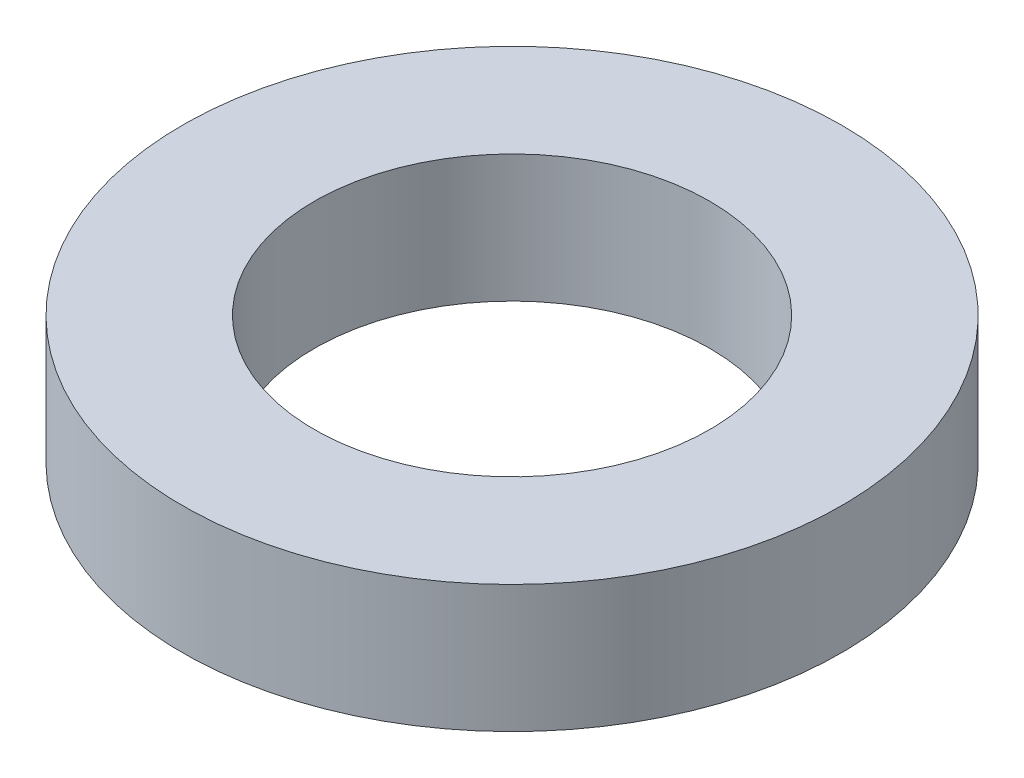
ISO-10303-21;
HEADER;
FILE_DESCRIPTION(('STEP AP214'),'2;1');
FILE_NAME('part.step','',(''),(''),'','','');
FILE_SCHEMA(('AUTOMOTIVE_DESIGN { 1 0 10303 214 1 1 1 1 }'));
ENDSEC;
DATA;
#1=APPLICATION_CONTEXT('core data for automotive mechanical design processes');
#2=APPLICATION_PROTOCOL_DEFINITION('international standard','automotive_design',2000,#1);
#3=PRODUCT_CONTEXT('',#1,'mechanical');
#4=PRODUCT('Part','Part','',(#3));
#5=PRODUCT_RELATED_PRODUCT_CATEGORY('part','',(#4));
#6=PRODUCT_DEFINITION_FORMATION('','',#4);
#7=PRODUCT_DEFINITION_CONTEXT('part definition',#1,'design');
#8=PRODUCT_DEFINITION('design','',#6,#7);
#9=PRODUCT_DEFINITION_SHAPE('','',#8);
#10=(LENGTH_UNIT() NAMED_UNIT(*) SI_UNIT(.MILLI.,.METRE.));
#11=(NAMED_UNIT(*) PLANE_ANGLE_UNIT() SI_UNIT($,.RADIAN.));
#12=(NAMED_UNIT(*) SI_UNIT($,.STERADIAN.) SOLID_ANGLE_UNIT());
#13=UNCERTAINTY_MEASURE_WITH_UNIT(LENGTH_MEASURE(1.E-05),#10,'distance_accuracy_value','');
#14=(GEOMETRIC_REPRESENTATION_CONTEXT(3) GLOBAL_UNCERTAINTY_ASSIGNED_CONTEXT((#13)) GLOBAL_UNIT_ASSIGNED_CONTEXT((#10,
#11,#12)) REPRESENTATION_CONTEXT('',''));
#15=CARTESIAN_POINT('',(0.,0.,0.));
#16=DIRECTION('',(0.,0.,1.));
#17=DIRECTION('',(1.,0.,0.));
#18=AXIS2_PLACEMENT_3D('',#15,#16,#17);
#19=CARTESIAN_POINT('',(0.,29.,0.));
#20=DIRECTION('',(0.,-1.,0.));
#21=DIRECTION('',(0.,0.,-1.));
#22=AXIS2_PLACEMENT_3D('',#19,#20,#21);
#23=CYLINDRICAL_SURFACE('',#22,75.);
#24=CARTESIAN_POINT('',(0.,29.,0.));
#25=DIRECTION('',(0.,1.,0.));
#26=DIRECTION('',(0.,0.,1.));
#27=AXIS2_PLACEMENT_3D('',#24,#25,#26);
#28=CIRCLE('',#27,75.);
#29=CARTESIAN_POINT('',(0.,29.,-75.));
#30=VERTEX_POINT('',#29);
#31=EDGE_CURVE('E10',#30,#30,#28,.T.);
#32=CARTESIAN_POINT('',(0.,0.,0.));
#33=DIRECTION('',(0.,1.,0.));
#34=DIRECTION('',(0.,0.,1.));
#35=AXIS2_PLACEMENT_3D('',#32,#33,#34);
#36=CIRCLE('',#35,75.);
#37=CARTESIAN_POINT('',(0.,0.,-75.));
#38=VERTEX_POINT('',#37);
#39=EDGE_CURVE('E37',#38,#38,#36,.T.);
#40=CARTESIAN_POINT('',(0.,29.,-75.));
#41=CARTESIAN_POINT('',(0.,28.6979166666667,-75.));
#42=CARTESIAN_POINT('',(0.,28.3958333333333,-75.));
#43=CARTESIAN_POINT('',(0.,27.7916666666667,-75.));
#44=CARTESIAN_POINT('',(0.,27.4895833333333,-75.));
#45=CARTESIAN_POINT('',(0.,26.8854166666667,-75.));
#46=CARTESIAN_POINT('',(0.,26.5833333333333,-75.));
#47=CARTESIAN_POINT('',(0.,25.9791666666667,-75.));
#48=CARTESIAN_POINT('',(0.,25.6770833333333,-75.));
#49=CARTESIAN_POINT('',(0.,25.0729166666667,-75.));
#50=CARTESIAN_POINT('',(0.,24.7708333333333,-75.));
#51=CARTESIAN_POINT('',(0.,24.1666666666667,-75.));
#52=CARTESIAN_POINT('',(0.,23.8645833333333,-75.));
#53=CARTESIAN_POINT('',(0.,23.2604166666667,-75.));
#54=CARTESIAN_POINT('',(0.,22.9583333333333,-75.));
#55=CARTESIAN_POINT('',(0.,22.3541666666667,-75.));
#56=CARTESIAN_POINT('',(0.,22.0520833333333,-75.));
#57=CARTESIAN_POINT('',(0.,21.4479166666667,-75.));
#58=CARTESIAN_POINT('',(0.,21.1458333333333,-75.));
#59=CARTESIAN_POINT('',(0.,20.5416666666667,-75.));
#60=CARTESIAN_POINT('',(0.,20.2395833333333,-75.));
#61=CARTESIAN_POINT('',(0.,19.6354166666667,-75.));
#62=CARTESIAN_POINT('',(0.,19.3333333333333,-75.));
#63=CARTESIAN_POINT('',(0.,18.7291666666667,-75.));
#64=CARTESIAN_POINT('',(0.,18.4270833333333,-75.));
#65=CARTESIAN_POINT('',(0.,17.8229166666667,-75.));
#66=CARTESIAN_POINT('',(0.,17.5208333333333,-75.));
#67=CARTESIAN_POINT('',(0.,16.9166666666667,-75.));
#68=CARTESIAN_POINT('',(0.,16.6145833333333,-75.));
#69=CARTESIAN_POINT('',(0.,16.0104166666667,-75.));
#70=CARTESIAN_POINT('',(0.,15.7083333333333,-75.));
#71=CARTESIAN_POINT('',(0.,15.1041666666667,-75.));
#72=CARTESIAN_POINT('',(0.,14.8020833333333,-75.));
#73=CARTESIAN_POINT('',(0.,14.1979166666667,-75.));
#74=CARTESIAN_POINT('',(0.,13.8958333333333,-75.));
#75=CARTESIAN_POINT('',(0.,13.2916666666667,-75.));
#76=CARTESIAN_POINT('',(0.,12.9895833333333,-75.));
#77=CARTESIAN_POINT('',(0.,12.3854166666667,-75.));
#78=CARTESIAN_POINT('',(0.,12.0833333333333,-75.));
#79=CARTESIAN_POINT('',(0.,11.4791666666667,-75.));
#80=CARTESIAN_POINT('',(0.,11.1770833333333,-75.));
#81=CARTESIAN_POINT('',(0.,10.5729166666667,-75.));
#82=CARTESIAN_POINT('',(0.,10.2708333333333,-75.));
#83=CARTESIAN_POINT('',(0.,9.66666666666667,-75.));
#84=CARTESIAN_POINT('',(0.,9.36458333333333,-75.));
#85=CARTESIAN_POINT('',(0.,8.76041666666667,-75.));
#86=CARTESIAN_POINT('',(0.,8.45833333333333,-75.));
#87=CARTESIAN_POINT('',(0.,7.85416666666667,-75.));
#88=CARTESIAN_POINT('',(0.,7.55208333333333,-75.));
#89=CARTESIAN_POINT('',(0.,6.94791666666667,-75.));
#90=CARTESIAN_POINT('',(0.,6.64583333333333,-75.));
#91=CARTESIAN_POINT('',(0.,6.04166666666667,-75.));
#92=CARTESIAN_POINT('',(0.,5.73958333333333,-75.));
#93=CARTESIAN_POINT('',(0.,5.13541666666667,-75.));
#94=CARTESIAN_POINT('',(0.,4.83333333333333,-75.));
#95=CARTESIAN_POINT('',(0.,4.22916666666667,-75.));
#96=CARTESIAN_POINT('',(0.,3.92708333333333,-75.));
#97=CARTESIAN_POINT('',(0.,3.32291666666667,-75.));
#98=CARTESIAN_POINT('',(0.,3.02083333333333,-75.));
#99=CARTESIAN_POINT('',(0.,2.41666666666667,-75.));
#100=CARTESIAN_POINT('',(0.,2.11458333333333,-75.));
#101=CARTESIAN_POINT('',(0.,1.51041666666667,-75.));
#102=CARTESIAN_POINT('',(0.,1.20833333333333,-75.));
#103=CARTESIAN_POINT('',(0.,0.604166666666667,-75.));
#104=CARTESIAN_POINT('',(0.,0.302083333333333,-75.));
#105=CARTESIAN_POINT('',(0.,0.,-75.));
#106=B_SPLINE_CURVE_WITH_KNOTS('',3,(#40,#41,#42,#43,#44,#45,#46,#47,#48,#49,#50,#51,#52,#53,
#54,#55,#56,#57,#58,#59,#60,#61,#62,#63,#64,#65,#66,#67,#68,#69,#70,#71,#72,#73,#74,#75,#76,#77,
#78,#79,#80,#81,#82,#83,#84,#85,#86,#87,#88,#89,#90,#91,#92,#93,#94,#95,#96,#97,#98,#99,#100,
#101,#102,#103,#104,#105),.UNSPECIFIED.,.F.,.F.,(4,2,2,2,2,2,2,2,2,2,2,2,2,2,2,2,2,2,2,2,2,2,2,
2,2,2,2,2,2,2,2,2,4),(0.,0.906250000000001,1.8125,2.71875,3.625,4.53125,5.4375,6.34375,7.25,
8.15625,9.0625,9.96875,10.875,11.78125,12.6875,13.59375,14.5,15.40625,16.3125,17.21875,18.125,
19.03125,19.9375,20.84375,21.75,22.65625,23.5625,24.46875,25.375,26.28125,27.1875,28.09375,29.),.UNSPECIFIED.);
#107=EDGE_CURVE('BSEAM40',#30,#38,#106,.T.);
#108=ORIENTED_EDGE('',*,*,#31,.F.);
#109=ORIENTED_EDGE('',*,*,#39,.T.);
#110=ORIENTED_EDGE('',*,*,#107,.T.);
#111=ORIENTED_EDGE('',*,*,#107,.F.);
#112=EDGE_LOOP('',(#108,#110,#109,#111));
#113=FACE_BOUND('',#112,.T.);
#114=ADVANCED_FACE('F40',(#113),#23,.T.);
#115=CARTESIAN_POINT('',(0.,29.,0.));
#116=DIRECTION('',(0.,1.,0.));
#117=DIRECTION('',(0.,0.,1.));
#118=AXIS2_PLACEMENT_3D('',#115,#116,#117);
#119=PLANE('',#118);
#120=CARTESIAN_POINT('',(0.,29.,0.));
#121=DIRECTION('',(0.,1.,0.));
#122=DIRECTION('',(0.,0.,1.));
#123=AXIS2_PLACEMENT_3D('',#120,#121,#122);
#124=CIRCLE('',#123,45.);
#125=CARTESIAN_POINT('',(0.,29.,-45.));
#126=VERTEX_POINT('',#125);
#127=EDGE_CURVE('E50',#126,#126,#124,.T.);
#128=ORIENTED_EDGE('',*,*,#127,.F.);
#129=EDGE_LOOP('',(#128));
#130=FACE_BOUND('',#129,.T.);
#131=ORIENTED_EDGE('',*,*,#31,.T.);
#132=EDGE_LOOP('',(#131));
#133=FACE_BOUND('',#132,.T.);
#134=ADVANCED_FACE('F59',(#130,#133),#119,.T.);
#135=CARTESIAN_POINT('',(0.,0.,0.));
#136=DIRECTION('',(0.,1.,0.));
#137=DIRECTION('',(0.,0.,1.));
#138=AXIS2_PLACEMENT_3D('',#135,#136,#137);
#139=PLANE('',#138);
#140=CARTESIAN_POINT('',(0.,0.,0.));
#141=DIRECTION('',(0.,1.,0.));
#142=DIRECTION('',(0.,0.,1.));
#143=AXIS2_PLACEMENT_3D('',#140,#141,#142);
#144=CIRCLE('',#143,45.);
#145=CARTESIAN_POINT('',(0.,0.,-45.));
#146=VERTEX_POINT('',#145);
#147=EDGE_CURVE('E47',#146,#146,#144,.T.);
#148=ORIENTED_EDGE('',*,*,#147,.T.);
#149=EDGE_LOOP('',(#148));
#150=FACE_BOUND('',#149,.T.);
#151=ORIENTED_EDGE('',*,*,#39,.F.);
#152=EDGE_LOOP('',(#151));
#153=FACE_BOUND('',#152,.T.);
#154=ADVANCED_FACE('F58',(#150,#153),#139,.F.);
#155=CARTESIAN_POINT('',(0.,29.,0.));
#156=DIRECTION('',(0.,-1.,0.));
#157=DIRECTION('',(0.,0.,-1.));
#158=AXIS2_PLACEMENT_3D('',#155,#156,#157);
#159=CYLINDRICAL_SURFACE('',#158,45.);
#160=CARTESIAN_POINT('',(0.,29.,-45.));
#161=CARTESIAN_POINT('',(0.,28.6979166666667,-45.));
#162=CARTESIAN_POINT('',(0.,28.3958333333333,-45.));
#163=CARTESIAN_POINT('',(0.,27.7916666666667,-45.));
#164=CARTESIAN_POINT('',(0.,27.4895833333333,-45.));
#165=CARTESIAN_POINT('',(0.,26.8854166666667,-45.));
#166=CARTESIAN_POINT('',(0.,26.5833333333333,-45.));
#167=CARTESIAN_POINT('',(0.,25.9791666666667,-45.));
#168=CARTESIAN_POINT('',(0.,25.6770833333333,-45.));
#169=CARTESIAN_POINT('',(0.,25.0729166666667,-45.));
#170=CARTESIAN_POINT('',(0.,24.7708333333333,-45.));
#171=CARTESIAN_POINT('',(0.,24.1666666666667,-45.));
#172=CARTESIAN_POINT('',(0.,23.8645833333333,-45.));
#173=CARTESIAN_POINT('',(0.,23.2604166666667,-45.));
#174=CARTESIAN_POINT('',(0.,22.9583333333333,-45.));
#175=CARTESIAN_POINT('',(0.,22.3541666666667,-45.));
#176=CARTESIAN_POINT('',(0.,22.0520833333333,-45.));
#177=CARTESIAN_POINT('',(0.,21.4479166666667,-45.));
#178=CARTESIAN_POINT('',(0.,21.1458333333333,-45.));
#179=CARTESIAN_POINT('',(0.,20.5416666666667,-45.));
#180=CARTESIAN_POINT('',(0.,20.2395833333333,-45.));
#181=CARTESIAN_POINT('',(0.,19.6354166666667,-45.));
#182=CARTESIAN_POINT('',(0.,19.3333333333333,-45.));
#183=CARTESIAN_POINT('',(0.,18.7291666666667,-45.));
#184=CARTESIAN_POINT('',(0.,18.4270833333333,-45.));
#185=CARTESIAN_POINT('',(0.,17.8229166666667,-45.));
#186=CARTESIAN_POINT('',(0.,17.5208333333333,-45.));
#187=CARTESIAN_POINT('',(0.,16.9166666666667,-45.));
#188=CARTESIAN_POINT('',(0.,16.6145833333333,-45.));
#189=CARTESIAN_POINT('',(0.,16.0104166666667,-45.));
#190=CARTESIAN_POINT('',(0.,15.7083333333333,-45.));
#191=CARTESIAN_POINT('',(0.,15.1041666666667,-45.));
#192=CARTESIAN_POINT('',(0.,14.8020833333333,-45.));
#193=CARTESIAN_POINT('',(0.,14.1979166666667,-45.));
#194=CARTESIAN_POINT('',(0.,13.8958333333333,-45.));
#195=CARTESIAN_POINT('',(0.,13.2916666666667,-45.));
#196=CARTESIAN_POINT('',(0.,12.9895833333333,-45.));
#197=CARTESIAN_POINT('',(0.,12.3854166666667,-45.));
#198=CARTESIAN_POINT('',(0.,12.0833333333333,-45.));
#199=CARTESIAN_POINT('',(0.,11.4791666666667,-45.));
#200=CARTESIAN_POINT('',(0.,11.1770833333333,-45.));
#201=CARTESIAN_POINT('',(0.,10.5729166666667,-45.));
#202=CARTESIAN_POINT('',(0.,10.2708333333333,-45.));
#203=CARTESIAN_POINT('',(0.,9.66666666666667,-45.));
#204=CARTESIAN_POINT('',(0.,9.36458333333333,-45.));
#205=CARTESIAN_POINT('',(0.,8.76041666666667,-45.));
#206=CARTESIAN_POINT('',(0.,8.45833333333333,-45.));
#207=CARTESIAN_POINT('',(0.,7.85416666666667,-45.));
#208=CARTESIAN_POINT('',(0.,7.55208333333333,-45.));
#209=CARTESIAN_POINT('',(0.,6.94791666666667,-45.));
#210=CARTESIAN_POINT('',(0.,6.64583333333333,-45.));
#211=CARTESIAN_POINT('',(0.,6.04166666666667,-45.));
#212=CARTESIAN_POINT('',(0.,5.73958333333333,-45.));
#213=CARTESIAN_POINT('',(0.,5.13541666666667,-45.));
#214=CARTESIAN_POINT('',(0.,4.83333333333333,-45.));
#215=CARTESIAN_POINT('',(0.,4.22916666666667,-45.));
#216=CARTESIAN_POINT('',(0.,3.92708333333333,-45.));
#217=CARTESIAN_POINT('',(0.,3.32291666666667,-45.));
#218=CARTESIAN_POINT('',(0.,3.02083333333333,-45.));
#219=CARTESIAN_POINT('',(0.,2.41666666666667,-45.));
#220=CARTESIAN_POINT('',(0.,2.11458333333333,-45.));
#221=CARTESIAN_POINT('',(0.,1.51041666666667,-45.));
#222=CARTESIAN_POINT('',(0.,1.20833333333333,-45.));
#223=CARTESIAN_POINT('',(0.,0.604166666666667,-45.));
#224=CARTESIAN_POINT('',(0.,0.302083333333333,-45.));
#225=CARTESIAN_POINT('',(0.,0.,-45.));
#226=B_SPLINE_CURVE_WITH_KNOTS('',3,(#160,#161,#162,#163,#164,#165,#166,#167,#168,#169,#170,
#171,#172,#173,#174,#175,#176,#177,#178,#179,#180,#181,#182,#183,#184,#185,#186,#187,#188,#189,
#190,#191,#192,#193,#194,#195,#196,#197,#198,#199,#200,#201,#202,#203,#204,#205,#206,#207,#208,
#209,#210,#211,#212,#213,#214,#215,#216,#217,#218,#219,#220,#221,#222,#223,#224,#225),
.UNSPECIFIED.,.F.,.F.,(4,2,2,2,2,2,2,2,2,2,2,2,2,2,2,2,2,2,2,2,2,2,2,2,2,2,2,2,2,2,2,2,4),(0.,
0.906249999999997,1.8125,2.71875,3.625,4.53125,5.4375,6.34375,7.25,8.15625,9.0625,9.96875,
10.875,11.78125,12.6875,13.59375,14.5,15.40625,16.3125,17.21875,18.125,19.03125,19.9375,
20.84375,21.75,22.65625,23.5625,24.46875,25.375,26.28125,27.1875,28.09375,29.),.UNSPECIFIED.);
#227=EDGE_CURVE('BSEAM54',#126,#146,#226,.T.);
#228=ORIENTED_EDGE('',*,*,#127,.T.);
#229=ORIENTED_EDGE('',*,*,#147,.F.);
#230=ORIENTED_EDGE('',*,*,#227,.T.);
#231=ORIENTED_EDGE('',*,*,#227,.F.);
#232=EDGE_LOOP('',(#228,#230,#229,#231));
#233=FACE_BOUND('',#232,.T.);
#234=ADVANCED_FACE('F54',(#233),#159,.F.);
#235=CLOSED_SHELL('',(#114,#134,#154,#234));
#236=MANIFOLD_SOLID_BREP('B2',#235);
#237=ADVANCED_BREP_SHAPE_REPRESENTATION('',(#18,#236),#14);
#238=SHAPE_DEFINITION_REPRESENTATION(#9,#237);
ENDSEC;
END-ISO-10303-21;
